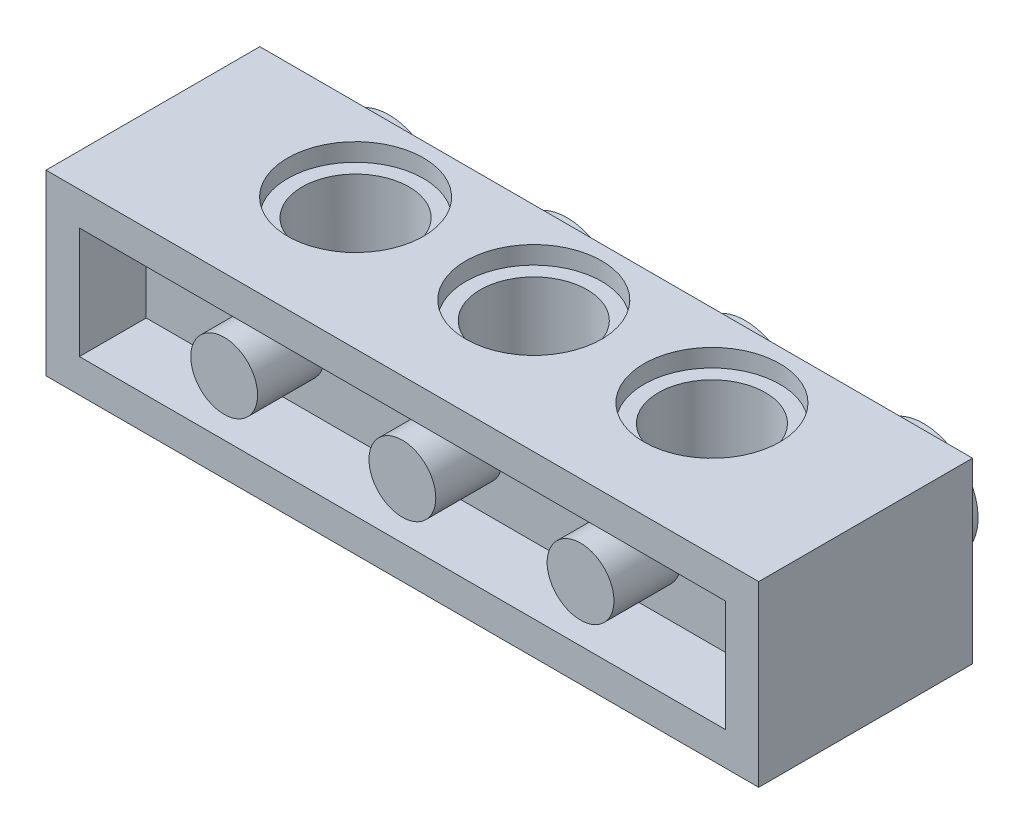
ISO-10303-21;
HEADER;
FILE_DESCRIPTION(('STEP AP214'),'2;1');
FILE_NAME('part.step','',(''),(''),'','','');
FILE_SCHEMA(('AUTOMOTIVE_DESIGN { 1 0 10303 214 1 1 1 1 }'));
ENDSEC;
DATA;
#1=APPLICATION_CONTEXT('core data for automotive mechanical design processes');
#2=APPLICATION_PROTOCOL_DEFINITION('international standard','automotive_design',2000,#1);
#3=PRODUCT_CONTEXT('',#1,'mechanical');
#4=PRODUCT('Part','Part','',(#3));
#5=PRODUCT_RELATED_PRODUCT_CATEGORY('part','',(#4));
#6=PRODUCT_DEFINITION_FORMATION('','',#4);
#7=PRODUCT_DEFINITION_CONTEXT('part definition',#1,'design');
#8=PRODUCT_DEFINITION('design','',#6,#7);
#9=PRODUCT_DEFINITION_SHAPE('','',#8);
#10=(LENGTH_UNIT() NAMED_UNIT(*) SI_UNIT(.MILLI.,.METRE.));
#11=(NAMED_UNIT(*) PLANE_ANGLE_UNIT() SI_UNIT($,.RADIAN.));
#12=(NAMED_UNIT(*) SI_UNIT($,.STERADIAN.) SOLID_ANGLE_UNIT());
#13=UNCERTAINTY_MEASURE_WITH_UNIT(LENGTH_MEASURE(1.E-05),#10,'distance_accuracy_value','');
#14=(GEOMETRIC_REPRESENTATION_CONTEXT(3) GLOBAL_UNCERTAINTY_ASSIGNED_CONTEXT((#13)) GLOBAL_UNIT_ASSIGNED_CONTEXT((#10,
#11,#12)) REPRESENTATION_CONTEXT('',''));
#15=CARTESIAN_POINT('',(0.,0.,0.));
#16=DIRECTION('',(0.,0.,1.));
#17=DIRECTION('',(1.,0.,0.));
#18=AXIS2_PLACEMENT_3D('',#15,#16,#17);
#19=CARTESIAN_POINT('',(0.,0.200000000000001,0.));
#20=DIRECTION('',(0.,1.,0.));
#21=DIRECTION('',(0.,0.,1.));
#22=AXIS2_PLACEMENT_3D('',#19,#20,#21);
#23=CYLINDRICAL_SURFACE('',#22,2.4);
#24=CARTESIAN_POINT('',(0.,7.2,0.));
#25=DIRECTION('',(0.,1.,0.));
#26=DIRECTION('',(0.,0.,1.));
#27=AXIS2_PLACEMENT_3D('',#24,#25,#26);
#28=CIRCLE('',#27,2.4);
#29=CARTESIAN_POINT('',(0.,7.2,2.4));
#30=VERTEX_POINT('',#29);
#31=EDGE_CURVE('E289',#30,#30,#28,.F.);
#32=ORIENTED_EDGE('',*,*,#31,.F.);
#33=EDGE_LOOP('',(#32));
#34=FACE_BOUND('',#33,.T.);
#35=CARTESIAN_POINT('',(0.,0.8,0.));
#36=DIRECTION('',(0.,-1.,0.));
#37=DIRECTION('',(0.,0.,-1.));
#38=AXIS2_PLACEMENT_3D('',#35,#36,#37);
#39=CIRCLE('',#38,2.4);
#40=CARTESIAN_POINT('',(0.,0.8,-2.4));
#41=VERTEX_POINT('',#40);
#42=EDGE_CURVE('E298',#41,#41,#39,.F.);
#43=ORIENTED_EDGE('',*,*,#42,.F.);
#44=EDGE_LOOP('',(#43));
#45=FACE_BOUND('',#44,.T.);
#46=ADVANCED_FACE('F39',(#34,#45),#23,.F.);
#47=CARTESIAN_POINT('',(8.,0.200000000000001,0.));
#48=DIRECTION('',(0.,1.,0.));
#49=DIRECTION('',(0.,0.,1.));
#50=AXIS2_PLACEMENT_3D('',#47,#48,#49);
#51=CYLINDRICAL_SURFACE('',#50,2.4);
#52=CARTESIAN_POINT('',(8.,7.2,0.));
#53=DIRECTION('',(0.,1.,0.));
#54=DIRECTION('',(0.,0.,1.));
#55=AXIS2_PLACEMENT_3D('',#52,#53,#54);
#56=CIRCLE('',#55,2.4);
#57=CARTESIAN_POINT('',(8.,7.2,2.4));
#58=VERTEX_POINT('',#57);
#59=EDGE_CURVE('E268',#58,#58,#56,.F.);
#60=ORIENTED_EDGE('',*,*,#59,.F.);
#61=EDGE_LOOP('',(#60));
#62=FACE_BOUND('',#61,.T.);
#63=CARTESIAN_POINT('',(8.,0.8,0.));
#64=DIRECTION('',(0.,-1.,0.));
#65=DIRECTION('',(0.,0.,-1.));
#66=AXIS2_PLACEMENT_3D('',#63,#64,#65);
#67=CIRCLE('',#66,2.4);
#68=CARTESIAN_POINT('',(8.,0.8,-2.4));
#69=VERTEX_POINT('',#68);
#70=EDGE_CURVE('E206',#69,#69,#67,.F.);
#71=ORIENTED_EDGE('',*,*,#70,.F.);
#72=EDGE_LOOP('',(#71));
#73=FACE_BOUND('',#72,.T.);
#74=ADVANCED_FACE('F335',(#62,#73),#51,.F.);
#75=CARTESIAN_POINT('',(0.,8.,0.));
#76=DIRECTION('',(0.,1.,0.));
#77=DIRECTION('',(0.,0.,1.));
#78=AXIS2_PLACEMENT_3D('',#75,#76,#77);
#79=PLANE('',#78);
#80=CARTESIAN_POINT('',(8.,8.,0.));
#81=DIRECTION('',(0.,1.,0.));
#82=DIRECTION('',(0.,0.,1.));
#83=AXIS2_PLACEMENT_3D('',#80,#81,#82);
#84=CIRCLE('',#83,3.05);
#85=CARTESIAN_POINT('',(8.,8.,3.05));
#86=VERTEX_POINT('',#85);
#87=EDGE_CURVE('E231',#86,#86,#84,.T.);
#88=ORIENTED_EDGE('',*,*,#87,.F.);
#89=EDGE_LOOP('',(#88));
#90=FACE_BOUND('',#89,.T.);
#91=CARTESIAN_POINT('',(0.,8.,0.));
#92=DIRECTION('',(0.,1.,0.));
#93=DIRECTION('',(0.,0.,1.));
#94=AXIS2_PLACEMENT_3D('',#91,#92,#93);
#95=CIRCLE('',#94,3.05);
#96=CARTESIAN_POINT('',(0.,8.,3.05));
#97=VERTEX_POINT('',#96);
#98=EDGE_CURVE('E239',#97,#97,#95,.T.);
#99=ORIENTED_EDGE('',*,*,#98,.F.);
#100=EDGE_LOOP('',(#99));
#101=FACE_BOUND('',#100,.T.);
#102=CARTESIAN_POINT('',(-8.,8.,0.));
#103=DIRECTION('',(0.,1.,0.));
#104=DIRECTION('',(0.,0.,-1.));
#105=AXIS2_PLACEMENT_3D('',#102,#103,#104);
#106=CIRCLE('',#105,3.05);
#107=CARTESIAN_POINT('',(-8.,8.,-3.05));
#108=VERTEX_POINT('',#107);
#109=EDGE_CURVE('E247',#108,#108,#106,.T.);
#110=ORIENTED_EDGE('',*,*,#109,.F.);
#111=EDGE_LOOP('',(#110));
#112=FACE_BOUND('',#111,.T.);
#113=DIRECTION('',(1.,0.,0.));
#114=VECTOR('',#113,1.);
#115=CARTESIAN_POINT('',(-16.,8.,5.9));
#116=LINE('',#115,#114);
#117=CARTESIAN_POINT('',(-16.,8.,5.9));
#118=VERTEX_POINT('',#117);
#119=CARTESIAN_POINT('',(16.,8.,5.9));
#120=VERTEX_POINT('',#119);
#121=EDGE_CURVE('E251',#118,#120,#116,.T.);
#122=ORIENTED_EDGE('',*,*,#121,.T.);
#123=DIRECTION('',(0.,0.,-1.));
#124=VECTOR('',#123,1.);
#125=CARTESIAN_POINT('',(16.,8.,5.9));
#126=LINE('',#125,#124);
#127=CARTESIAN_POINT('',(16.,8.,-3.7));
#128=VERTEX_POINT('',#127);
#129=EDGE_CURVE('E92',#120,#128,#126,.T.);
#130=ORIENTED_EDGE('',*,*,#129,.T.);
#131=DIRECTION('',(1.,0.,0.));
#132=VECTOR('',#131,1.);
#133=CARTESIAN_POINT('',(-16.,8.,-3.7));
#134=LINE('',#133,#132);
#135=CARTESIAN_POINT('',(-16.,8.,-3.7));
#136=VERTEX_POINT('',#135);
#137=EDGE_CURVE('E257',#136,#128,#134,.T.);
#138=ORIENTED_EDGE('',*,*,#137,.F.);
#139=DIRECTION('',(0.,0.,-1.));
#140=VECTOR('',#139,1.);
#141=CARTESIAN_POINT('',(-16.,8.,5.9));
#142=LINE('',#141,#140);
#143=EDGE_CURVE('E261',#118,#136,#142,.T.);
#144=ORIENTED_EDGE('',*,*,#143,.F.);
#145=EDGE_LOOP('',(#122,#130,#138,#144));
#146=FACE_BOUND('',#145,.T.);
#147=ADVANCED_FACE('F332',(#90,#101,#112,#146),#79,.T.);
#148=CARTESIAN_POINT('',(-16.,8.,5.9));
#149=DIRECTION('',(0.,0.,-1.));
#150=DIRECTION('',(-1.,0.,0.));
#151=AXIS2_PLACEMENT_3D('',#148,#149,#150);
#152=PLANE('',#151);
#153=DIRECTION('',(1.,0.,0.));
#154=VECTOR('',#153,1.);
#155=CARTESIAN_POINT('',(-14.5,1.5,5.9));
#156=LINE('',#155,#154);
#157=CARTESIAN_POINT('',(-14.5,1.5,5.9));
#158=VERTEX_POINT('',#157);
#159=CARTESIAN_POINT('',(14.5,1.5,5.9));
#160=VERTEX_POINT('',#159);
#161=EDGE_CURVE('E154',#158,#160,#156,.T.);
#162=ORIENTED_EDGE('',*,*,#161,.F.);
#163=DIRECTION('',(0.,-1.,0.));
#164=VECTOR('',#163,1.);
#165=CARTESIAN_POINT('',(-14.5,6.5,5.9));
#166=LINE('',#165,#164);
#167=CARTESIAN_POINT('',(-14.5,6.5,5.9));
#168=VERTEX_POINT('',#167);
#169=EDGE_CURVE('E57',#168,#158,#166,.T.);
#170=ORIENTED_EDGE('',*,*,#169,.F.);
#171=DIRECTION('',(-1.,0.,0.));
#172=VECTOR('',#171,1.);
#173=CARTESIAN_POINT('',(-14.5,6.5,5.9));
#174=LINE('',#173,#172);
#175=CARTESIAN_POINT('',(14.5,6.5,5.9));
#176=VERTEX_POINT('',#175);
#177=EDGE_CURVE('E138',#176,#168,#174,.T.);
#178=ORIENTED_EDGE('',*,*,#177,.F.);
#179=DIRECTION('',(0.,1.,0.));
#180=VECTOR('',#179,1.);
#181=CARTESIAN_POINT('',(14.5,6.5,5.9));
#182=LINE('',#181,#180);
#183=EDGE_CURVE('E142',#160,#176,#182,.T.);
#184=ORIENTED_EDGE('',*,*,#183,.F.);
#185=EDGE_LOOP('',(#162,#170,#178,#184));
#186=FACE_BOUND('',#185,.T.);
#187=DIRECTION('',(1.,0.,0.));
#188=VECTOR('',#187,1.);
#189=CARTESIAN_POINT('',(-16.,0.,5.9));
#190=LINE('',#189,#188);
#191=CARTESIAN_POINT('',(-16.,0.,5.9));
#192=VERTEX_POINT('',#191);
#193=CARTESIAN_POINT('',(16.,0.,5.9));
#194=VERTEX_POINT('',#193);
#195=EDGE_CURVE('E264',#192,#194,#190,.T.);
#196=ORIENTED_EDGE('',*,*,#195,.T.);
#197=DIRECTION('',(0.,-1.,0.));
#198=VECTOR('',#197,1.);
#199=CARTESIAN_POINT('',(16.,8.,5.9));
#200=LINE('',#199,#198);
#201=EDGE_CURVE('E11',#120,#194,#200,.T.);
#202=ORIENTED_EDGE('',*,*,#201,.F.);
#203=ORIENTED_EDGE('',*,*,#121,.F.);
#204=DIRECTION('',(0.,-1.,0.));
#205=VECTOR('',#204,1.);
#206=CARTESIAN_POINT('',(-16.,8.,5.9));
#207=LINE('',#206,#205);
#208=EDGE_CURVE('E66',#118,#192,#207,.T.);
#209=ORIENTED_EDGE('',*,*,#208,.T.);
#210=EDGE_LOOP('',(#196,#202,#203,#209));
#211=FACE_BOUND('',#210,.T.);
#212=ADVANCED_FACE('F41',(#186,#211),#152,.F.);
#213=CARTESIAN_POINT('',(16.,8.,5.9));
#214=DIRECTION('',(-1.,0.,0.));
#215=DIRECTION('',(0.,0.,1.));
#216=AXIS2_PLACEMENT_3D('',#213,#214,#215);
#217=PLANE('',#216);
#218=DIRECTION('',(0.,0.,-1.));
#219=VECTOR('',#218,1.);
#220=CARTESIAN_POINT('',(16.,0.,5.9));
#221=LINE('',#220,#219);
#222=CARTESIAN_POINT('',(16.,0.,-3.7));
#223=VERTEX_POINT('',#222);
#224=EDGE_CURVE('E267',#194,#223,#221,.T.);
#225=ORIENTED_EDGE('',*,*,#224,.T.);
#226=DIRECTION('',(0.,-1.,0.));
#227=VECTOR('',#226,1.);
#228=CARTESIAN_POINT('',(16.,8.,-3.7));
#229=LINE('',#228,#227);
#230=EDGE_CURVE('E49',#128,#223,#229,.T.);
#231=ORIENTED_EDGE('',*,*,#230,.F.);
#232=ORIENTED_EDGE('',*,*,#129,.F.);
#233=ORIENTED_EDGE('',*,*,#201,.T.);
#234=EDGE_LOOP('',(#225,#231,#232,#233));
#235=FACE_BOUND('',#234,.T.);
#236=ADVANCED_FACE('F341',(#235),#217,.F.);
#237=CARTESIAN_POINT('',(-16.,8.,-3.7));
#238=DIRECTION('',(0.,0.,-1.));
#239=DIRECTION('',(-1.,0.,0.));
#240=AXIS2_PLACEMENT_3D('',#237,#238,#239);
#241=PLANE('',#240);
#242=CARTESIAN_POINT('',(-12.,4.,-3.7));
#243=DIRECTION('',(0.,0.,-1.));
#244=DIRECTION('',(1.,0.,0.));
#245=AXIS2_PLACEMENT_3D('',#242,#243,#244);
#246=CIRCLE('',#245,2.45);
#247=CARTESIAN_POINT('',(-9.55,4.,-3.7));
#248=VERTEX_POINT('',#247);
#249=EDGE_CURVE('E164',#248,#248,#246,.T.);
#250=ORIENTED_EDGE('',*,*,#249,.F.);
#251=EDGE_LOOP('',(#250));
#252=FACE_BOUND('',#251,.T.);
#253=CARTESIAN_POINT('',(4.,4.,-3.7));
#254=DIRECTION('',(0.,0.,-1.));
#255=DIRECTION('',(1.,0.,0.));
#256=AXIS2_PLACEMENT_3D('',#253,#254,#255);
#257=CIRCLE('',#256,2.45);
#258=CARTESIAN_POINT('',(6.45,4.,-3.7));
#259=VERTEX_POINT('',#258);
#260=EDGE_CURVE('E174',#259,#259,#257,.T.);
#261=ORIENTED_EDGE('',*,*,#260,.F.);
#262=EDGE_LOOP('',(#261));
#263=FACE_BOUND('',#262,.T.);
#264=CARTESIAN_POINT('',(-4.,4.,-3.7));
#265=DIRECTION('',(0.,0.,-1.));
#266=DIRECTION('',(-1.,0.,0.));
#267=AXIS2_PLACEMENT_3D('',#264,#265,#266);
#268=CIRCLE('',#267,2.45);
#269=CARTESIAN_POINT('',(-6.45,4.,-3.7));
#270=VERTEX_POINT('',#269);
#271=EDGE_CURVE('E182',#270,#270,#268,.T.);
#272=ORIENTED_EDGE('',*,*,#271,.F.);
#273=EDGE_LOOP('',(#272));
#274=FACE_BOUND('',#273,.T.);
#275=CARTESIAN_POINT('',(12.,4.,-3.7));
#276=DIRECTION('',(0.,0.,-1.));
#277=DIRECTION('',(-1.,0.,0.));
#278=AXIS2_PLACEMENT_3D('',#275,#276,#277);
#279=CIRCLE('',#278,2.45);
#280=CARTESIAN_POINT('',(9.55,4.,-3.7));
#281=VERTEX_POINT('',#280);
#282=EDGE_CURVE('E190',#281,#281,#279,.T.);
#283=ORIENTED_EDGE('',*,*,#282,.F.);
#284=EDGE_LOOP('',(#283));
#285=FACE_BOUND('',#284,.T.);
#286=DIRECTION('',(1.,0.,0.));
#287=VECTOR('',#286,1.);
#288=CARTESIAN_POINT('',(-16.,0.,-3.7));
#289=LINE('',#288,#287);
#290=CARTESIAN_POINT('',(-16.,0.,-3.7));
#291=VERTEX_POINT('',#290);
#292=EDGE_CURVE('E272',#291,#223,#289,.T.);
#293=ORIENTED_EDGE('',*,*,#292,.F.);
#294=DIRECTION('',(0.,-1.,0.));
#295=VECTOR('',#294,1.);
#296=CARTESIAN_POINT('',(-16.,8.,-3.7));
#297=LINE('',#296,#295);
#298=EDGE_CURVE('E281',#136,#291,#297,.T.);
#299=ORIENTED_EDGE('',*,*,#298,.F.);
#300=ORIENTED_EDGE('',*,*,#137,.T.);
#301=ORIENTED_EDGE('',*,*,#230,.T.);
#302=EDGE_LOOP('',(#293,#299,#300,#301));
#303=FACE_BOUND('',#302,.T.);
#304=ADVANCED_FACE('F345',(#252,#263,#274,#285,#303),#241,.T.);
#305=CARTESIAN_POINT('',(-16.,8.,5.9));
#306=DIRECTION('',(-1.,0.,0.));
#307=DIRECTION('',(0.,0.,1.));
#308=AXIS2_PLACEMENT_3D('',#305,#306,#307);
#309=PLANE('',#308);
#310=DIRECTION('',(0.,0.,-1.));
#311=VECTOR('',#310,1.);
#312=CARTESIAN_POINT('',(-16.,0.,5.9));
#313=LINE('',#312,#311);
#314=EDGE_CURVE('E254',#192,#291,#313,.T.);
#315=ORIENTED_EDGE('',*,*,#314,.F.);
#316=ORIENTED_EDGE('',*,*,#208,.F.);
#317=ORIENTED_EDGE('',*,*,#143,.T.);
#318=ORIENTED_EDGE('',*,*,#298,.T.);
#319=EDGE_LOOP('',(#315,#316,#317,#318));
#320=FACE_BOUND('',#319,.T.);
#321=ADVANCED_FACE('F346',(#320),#309,.T.);
#322=CARTESIAN_POINT('',(0.,0.,0.));
#323=DIRECTION('',(0.,1.,0.));
#324=DIRECTION('',(0.,0.,1.));
#325=AXIS2_PLACEMENT_3D('',#322,#323,#324);
#326=PLANE('',#325);
#327=CARTESIAN_POINT('',(8.,0.,0.));
#328=DIRECTION('',(0.,-1.,0.));
#329=DIRECTION('',(0.,0.,-1.));
#330=AXIS2_PLACEMENT_3D('',#327,#328,#329);
#331=CIRCLE('',#330,3.05);
#332=CARTESIAN_POINT('',(8.,0.,-3.05));
#333=VERTEX_POINT('',#332);
#334=EDGE_CURVE('E207',#333,#333,#331,.T.);
#335=ORIENTED_EDGE('',*,*,#334,.F.);
#336=EDGE_LOOP('',(#335));
#337=FACE_BOUND('',#336,.T.);
#338=CARTESIAN_POINT('',(0.,0.,0.));
#339=DIRECTION('',(0.,-1.,0.));
#340=DIRECTION('',(0.,0.,-1.));
#341=AXIS2_PLACEMENT_3D('',#338,#339,#340);
#342=CIRCLE('',#341,3.05);
#343=CARTESIAN_POINT('',(0.,0.,-3.05));
#344=VERTEX_POINT('',#343);
#345=EDGE_CURVE('E215',#344,#344,#342,.T.);
#346=ORIENTED_EDGE('',*,*,#345,.F.);
#347=EDGE_LOOP('',(#346));
#348=FACE_BOUND('',#347,.T.);
#349=CARTESIAN_POINT('',(-8.,0.,0.));
#350=DIRECTION('',(0.,-1.,0.));
#351=DIRECTION('',(0.,0.,1.));
#352=AXIS2_PLACEMENT_3D('',#349,#350,#351);
#353=CIRCLE('',#352,3.05);
#354=CARTESIAN_POINT('',(-8.,0.,3.05));
#355=VERTEX_POINT('',#354);
#356=EDGE_CURVE('E198',#355,#355,#353,.T.);
#357=ORIENTED_EDGE('',*,*,#356,.F.);
#358=EDGE_LOOP('',(#357));
#359=FACE_BOUND('',#358,.T.);
#360=ORIENTED_EDGE('',*,*,#195,.F.);
#361=ORIENTED_EDGE('',*,*,#314,.T.);
#362=ORIENTED_EDGE('',*,*,#292,.T.);
#363=ORIENTED_EDGE('',*,*,#224,.F.);
#364=EDGE_LOOP('',(#360,#361,#362,#363));
#365=FACE_BOUND('',#364,.T.);
#366=ADVANCED_FACE('F328',(#337,#348,#359,#365),#326,.F.);
#367=CARTESIAN_POINT('',(-8.,7.2,0.));
#368=DIRECTION('',(0.,1.,0.));
#369=DIRECTION('',(0.,0.,1.));
#370=AXIS2_PLACEMENT_3D('',#367,#368,#369);
#371=CYLINDRICAL_SURFACE('',#370,3.05);
#372=CARTESIAN_POINT('',(-8.,7.2,0.));
#373=DIRECTION('',(0.,1.,0.));
#374=DIRECTION('',(0.,0.,-1.));
#375=AXIS2_PLACEMENT_3D('',#372,#373,#374);
#376=CIRCLE('',#375,3.05);
#377=CARTESIAN_POINT('',(-8.,7.2,-3.05));
#378=VERTEX_POINT('',#377);
#379=EDGE_CURVE('E243',#378,#378,#376,.T.);
#380=ORIENTED_EDGE('',*,*,#379,.F.);
#381=EDGE_LOOP('',(#380));
#382=FACE_BOUND('',#381,.T.);
#383=ORIENTED_EDGE('',*,*,#109,.T.);
#384=EDGE_LOOP('',(#383));
#385=FACE_BOUND('',#384,.T.);
#386=ADVANCED_FACE('F322',(#382,#385),#371,.F.);
#387=CARTESIAN_POINT('',(-8.,7.2,0.));
#388=DIRECTION('',(0.,-1.,0.));
#389=DIRECTION('',(0.,0.,-1.));
#390=AXIS2_PLACEMENT_3D('',#387,#388,#389);
#391=PLANE('',#390);
#392=CARTESIAN_POINT('',(-8.,7.2,0.));
#393=DIRECTION('',(0.,-1.,0.));
#394=DIRECTION('',(0.,0.,-1.));
#395=AXIS2_PLACEMENT_3D('',#392,#393,#394);
#396=CIRCLE('',#395,2.4);
#397=CARTESIAN_POINT('',(-8.,7.2,-2.4));
#398=VERTEX_POINT('',#397);
#399=EDGE_CURVE('E230',#398,#398,#396,.T.);
#400=ORIENTED_EDGE('',*,*,#399,.T.);
#401=EDGE_LOOP('',(#400));
#402=FACE_BOUND('',#401,.T.);
#403=ORIENTED_EDGE('',*,*,#379,.T.);
#404=EDGE_LOOP('',(#403));
#405=FACE_BOUND('',#404,.T.);
#406=ADVANCED_FACE('F318',(#402,#405),#391,.F.);
#407=CARTESIAN_POINT('',(0.,7.2,0.));
#408=DIRECTION('',(0.,1.,0.));
#409=DIRECTION('',(0.,0.,1.));
#410=AXIS2_PLACEMENT_3D('',#407,#408,#409);
#411=PLANE('',#410);
#412=CARTESIAN_POINT('',(0.,7.2,0.));
#413=DIRECTION('',(0.,1.,0.));
#414=DIRECTION('',(0.,0.,1.));
#415=AXIS2_PLACEMENT_3D('',#412,#413,#414);
#416=CIRCLE('',#415,3.05);
#417=CARTESIAN_POINT('',(0.,7.2,3.05));
#418=VERTEX_POINT('',#417);
#419=EDGE_CURVE('E235',#418,#418,#416,.T.);
#420=ORIENTED_EDGE('',*,*,#419,.T.);
#421=EDGE_LOOP('',(#420));
#422=FACE_BOUND('',#421,.T.);
#423=ORIENTED_EDGE('',*,*,#31,.T.);
#424=EDGE_LOOP('',(#423));
#425=FACE_BOUND('',#424,.T.);
#426=ADVANCED_FACE('F321',(#422,#425),#411,.T.);
#427=CARTESIAN_POINT('',(0.,7.2,0.));
#428=DIRECTION('',(0.,1.,0.));
#429=DIRECTION('',(0.,0.,1.));
#430=AXIS2_PLACEMENT_3D('',#427,#428,#429);
#431=CYLINDRICAL_SURFACE('',#430,3.05);
#432=ORIENTED_EDGE('',*,*,#419,.F.);
#433=EDGE_LOOP('',(#432));
#434=FACE_BOUND('',#433,.T.);
#435=ORIENTED_EDGE('',*,*,#98,.T.);
#436=EDGE_LOOP('',(#435));
#437=FACE_BOUND('',#436,.T.);
#438=ADVANCED_FACE('F368',(#434,#437),#431,.F.);
#439=CARTESIAN_POINT('',(8.,7.2,0.));
#440=DIRECTION('',(0.,1.,0.));
#441=DIRECTION('',(0.,0.,1.));
#442=AXIS2_PLACEMENT_3D('',#439,#440,#441);
#443=PLANE('',#442);
#444=CARTESIAN_POINT('',(8.,7.2,0.));
#445=DIRECTION('',(0.,1.,0.));
#446=DIRECTION('',(0.,0.,1.));
#447=AXIS2_PLACEMENT_3D('',#444,#445,#446);
#448=CIRCLE('',#447,3.05);
#449=CARTESIAN_POINT('',(8.,7.2,3.05));
#450=VERTEX_POINT('',#449);
#451=EDGE_CURVE('E226',#450,#450,#448,.T.);
#452=ORIENTED_EDGE('',*,*,#451,.T.);
#453=EDGE_LOOP('',(#452));
#454=FACE_BOUND('',#453,.T.);
#455=ORIENTED_EDGE('',*,*,#59,.T.);
#456=EDGE_LOOP('',(#455));
#457=FACE_BOUND('',#456,.T.);
#458=ADVANCED_FACE('F371',(#454,#457),#443,.T.);
#459=CARTESIAN_POINT('',(8.,7.2,0.));
#460=DIRECTION('',(0.,1.,0.));
#461=DIRECTION('',(0.,0.,1.));
#462=AXIS2_PLACEMENT_3D('',#459,#460,#461);
#463=CYLINDRICAL_SURFACE('',#462,3.05);
#464=ORIENTED_EDGE('',*,*,#451,.F.);
#465=EDGE_LOOP('',(#464));
#466=FACE_BOUND('',#465,.T.);
#467=ORIENTED_EDGE('',*,*,#87,.T.);
#468=EDGE_LOOP('',(#467));
#469=FACE_BOUND('',#468,.T.);
#470=ADVANCED_FACE('F314',(#466,#469),#463,.F.);
#471=CARTESIAN_POINT('',(-8.,0.200000000000001,0.));
#472=DIRECTION('',(0.,1.,0.));
#473=DIRECTION('',(0.,0.,1.));
#474=AXIS2_PLACEMENT_3D('',#471,#472,#473);
#475=CYLINDRICAL_SURFACE('',#474,2.4);
#476=CARTESIAN_POINT('',(-8.,0.8,0.));
#477=DIRECTION('',(0.,1.,0.));
#478=DIRECTION('',(0.,0.,1.));
#479=AXIS2_PLACEMENT_3D('',#476,#477,#478);
#480=CIRCLE('',#479,2.4);
#481=CARTESIAN_POINT('',(-8.,0.8,2.4));
#482=VERTEX_POINT('',#481);
#483=EDGE_CURVE('E43',#482,#482,#480,.T.);
#484=ORIENTED_EDGE('',*,*,#483,.F.);
#485=EDGE_LOOP('',(#484));
#486=FACE_BOUND('',#485,.T.);
#487=ORIENTED_EDGE('',*,*,#399,.F.);
#488=EDGE_LOOP('',(#487));
#489=FACE_BOUND('',#488,.T.);
#490=ADVANCED_FACE('F310',(#486,#489),#475,.F.);
#491=CARTESIAN_POINT('',(8.,0.8,0.));
#492=DIRECTION('',(0.,-1.,0.));
#493=DIRECTION('',(0.,0.,-1.));
#494=AXIS2_PLACEMENT_3D('',#491,#492,#493);
#495=PLANE('',#494);
#496=CARTESIAN_POINT('',(8.,0.8,0.));
#497=DIRECTION('',(0.,-1.,0.));
#498=DIRECTION('',(0.,0.,-1.));
#499=AXIS2_PLACEMENT_3D('',#496,#497,#498);
#500=CIRCLE('',#499,3.05);
#501=CARTESIAN_POINT('',(8.,0.8,-3.05));
#502=VERTEX_POINT('',#501);
#503=EDGE_CURVE('E202',#502,#502,#500,.T.);
#504=ORIENTED_EDGE('',*,*,#503,.T.);
#505=EDGE_LOOP('',(#504));
#506=FACE_BOUND('',#505,.T.);
#507=ORIENTED_EDGE('',*,*,#70,.T.);
#508=EDGE_LOOP('',(#507));
#509=FACE_BOUND('',#508,.T.);
#510=ADVANCED_FACE('F313',(#506,#509),#495,.T.);
#511=CARTESIAN_POINT('',(8.,0.8,0.));
#512=DIRECTION('',(0.,-1.,0.));
#513=DIRECTION('',(0.,0.,-1.));
#514=AXIS2_PLACEMENT_3D('',#511,#512,#513);
#515=CYLINDRICAL_SURFACE('',#514,3.05);
#516=ORIENTED_EDGE('',*,*,#503,.F.);
#517=EDGE_LOOP('',(#516));
#518=FACE_BOUND('',#517,.T.);
#519=ORIENTED_EDGE('',*,*,#334,.T.);
#520=EDGE_LOOP('',(#519));
#521=FACE_BOUND('',#520,.T.);
#522=ADVANCED_FACE('F396',(#518,#521),#515,.F.);
#523=CARTESIAN_POINT('',(0.,0.8,0.));
#524=DIRECTION('',(0.,-1.,0.));
#525=DIRECTION('',(0.,0.,-1.));
#526=AXIS2_PLACEMENT_3D('',#523,#524,#525);
#527=PLANE('',#526);
#528=CARTESIAN_POINT('',(0.,0.8,0.));
#529=DIRECTION('',(0.,-1.,0.));
#530=DIRECTION('',(0.,0.,-1.));
#531=AXIS2_PLACEMENT_3D('',#528,#529,#530);
#532=CIRCLE('',#531,3.05);
#533=CARTESIAN_POINT('',(0.,0.8,-3.05));
#534=VERTEX_POINT('',#533);
#535=EDGE_CURVE('E211',#534,#534,#532,.T.);
#536=ORIENTED_EDGE('',*,*,#535,.T.);
#537=EDGE_LOOP('',(#536));
#538=FACE_BOUND('',#537,.T.);
#539=ORIENTED_EDGE('',*,*,#42,.T.);
#540=EDGE_LOOP('',(#539));
#541=FACE_BOUND('',#540,.T.);
#542=ADVANCED_FACE('F392',(#538,#541),#527,.T.);
#543=CARTESIAN_POINT('',(0.,0.8,0.));
#544=DIRECTION('',(0.,-1.,0.));
#545=DIRECTION('',(0.,0.,-1.));
#546=AXIS2_PLACEMENT_3D('',#543,#544,#545);
#547=CYLINDRICAL_SURFACE('',#546,3.05);
#548=ORIENTED_EDGE('',*,*,#535,.F.);
#549=EDGE_LOOP('',(#548));
#550=FACE_BOUND('',#549,.T.);
#551=ORIENTED_EDGE('',*,*,#345,.T.);
#552=EDGE_LOOP('',(#551));
#553=FACE_BOUND('',#552,.T.);
#554=ADVANCED_FACE('F385',(#550,#553),#547,.F.);
#555=CARTESIAN_POINT('',(-8.,0.8,0.));
#556=DIRECTION('',(0.,-1.,0.));
#557=DIRECTION('',(0.,0.,-1.));
#558=AXIS2_PLACEMENT_3D('',#555,#556,#557);
#559=CYLINDRICAL_SURFACE('',#558,3.05);
#560=CARTESIAN_POINT('',(-8.,0.8,0.));
#561=DIRECTION('',(0.,-1.,0.));
#562=DIRECTION('',(0.,0.,1.));
#563=AXIS2_PLACEMENT_3D('',#560,#561,#562);
#564=CIRCLE('',#563,3.05);
#565=CARTESIAN_POINT('',(-8.,0.8,3.05));
#566=VERTEX_POINT('',#565);
#567=EDGE_CURVE('E219',#566,#566,#564,.T.);
#568=ORIENTED_EDGE('',*,*,#567,.F.);
#569=EDGE_LOOP('',(#568));
#570=FACE_BOUND('',#569,.T.);
#571=ORIENTED_EDGE('',*,*,#356,.T.);
#572=EDGE_LOOP('',(#571));
#573=FACE_BOUND('',#572,.T.);
#574=ADVANCED_FACE('F382',(#570,#573),#559,.F.);
#575=CARTESIAN_POINT('',(-8.,0.8,0.));
#576=DIRECTION('',(0.,1.,0.));
#577=DIRECTION('',(0.,0.,1.));
#578=AXIS2_PLACEMENT_3D('',#575,#576,#577);
#579=PLANE('',#578);
#580=ORIENTED_EDGE('',*,*,#483,.T.);
#581=EDGE_LOOP('',(#580));
#582=FACE_BOUND('',#581,.T.);
#583=ORIENTED_EDGE('',*,*,#567,.T.);
#584=EDGE_LOOP('',(#583));
#585=FACE_BOUND('',#584,.T.);
#586=ADVANCED_FACE('F307',(#582,#585),#579,.F.);
#587=CARTESIAN_POINT('',(12.,4.,-5.5));
#588=DIRECTION('',(0.,0.,1.));
#589=DIRECTION('',(1.,0.,0.));
#590=AXIS2_PLACEMENT_3D('',#587,#588,#589);
#591=CYLINDRICAL_SURFACE('',#590,2.45);
#592=CARTESIAN_POINT('',(12.,4.,-5.5));
#593=DIRECTION('',(0.,0.,-1.));
#594=DIRECTION('',(-1.,0.,0.));
#595=AXIS2_PLACEMENT_3D('',#592,#593,#594);
#596=CIRCLE('',#595,2.45);
#597=CARTESIAN_POINT('',(9.55,4.,-5.5));
#598=VERTEX_POINT('',#597);
#599=EDGE_CURVE('E194',#598,#598,#596,.T.);
#600=ORIENTED_EDGE('',*,*,#599,.F.);
#601=EDGE_LOOP('',(#600));
#602=FACE_BOUND('',#601,.T.);
#603=ORIENTED_EDGE('',*,*,#282,.T.);
#604=EDGE_LOOP('',(#603));
#605=FACE_BOUND('',#604,.T.);
#606=ADVANCED_FACE('F389',(#602,#605),#591,.T.);
#607=CARTESIAN_POINT('',(12.,4.,-5.5));
#608=DIRECTION('',(0.,0.,-1.));
#609=DIRECTION('',(-1.,0.,0.));
#610=AXIS2_PLACEMENT_3D('',#607,#608,#609);
#611=PLANE('',#610);
#612=ORIENTED_EDGE('',*,*,#599,.T.);
#613=EDGE_LOOP('',(#612));
#614=FACE_BOUND('',#613,.T.);
#615=ADVANCED_FACE('F406',(#614),#611,.T.);
#616=CARTESIAN_POINT('',(-4.,4.,-5.5));
#617=DIRECTION('',(0.,0.,1.));
#618=DIRECTION('',(1.,0.,0.));
#619=AXIS2_PLACEMENT_3D('',#616,#617,#618);
#620=CYLINDRICAL_SURFACE('',#619,2.45);
#621=CARTESIAN_POINT('',(-4.,4.,-5.5));
#622=DIRECTION('',(0.,0.,-1.));
#623=DIRECTION('',(-1.,0.,0.));
#624=AXIS2_PLACEMENT_3D('',#621,#622,#623);
#625=CIRCLE('',#624,2.45);
#626=CARTESIAN_POINT('',(-6.45,4.,-5.5));
#627=VERTEX_POINT('',#626);
#628=EDGE_CURVE('E186',#627,#627,#625,.T.);
#629=ORIENTED_EDGE('',*,*,#628,.F.);
#630=EDGE_LOOP('',(#629));
#631=FACE_BOUND('',#630,.T.);
#632=ORIENTED_EDGE('',*,*,#271,.T.);
#633=EDGE_LOOP('',(#632));
#634=FACE_BOUND('',#633,.T.);
#635=ADVANCED_FACE('F410',(#631,#634),#620,.T.);
#636=CARTESIAN_POINT('',(-4.,4.,-5.5));
#637=DIRECTION('',(0.,0.,-1.));
#638=DIRECTION('',(-1.,0.,0.));
#639=AXIS2_PLACEMENT_3D('',#636,#637,#638);
#640=PLANE('',#639);
#641=ORIENTED_EDGE('',*,*,#628,.T.);
#642=EDGE_LOOP('',(#641));
#643=FACE_BOUND('',#642,.T.);
#644=ADVANCED_FACE('F414',(#643),#640,.T.);
#645=CARTESIAN_POINT('',(4.,4.,-5.5));
#646=DIRECTION('',(0.,0.,1.));
#647=DIRECTION('',(1.,0.,0.));
#648=AXIS2_PLACEMENT_3D('',#645,#646,#647);
#649=CYLINDRICAL_SURFACE('',#648,2.45);
#650=CARTESIAN_POINT('',(4.,4.,-5.5));
#651=DIRECTION('',(0.,0.,-1.));
#652=DIRECTION('',(1.,0.,0.));
#653=AXIS2_PLACEMENT_3D('',#650,#651,#652);
#654=CIRCLE('',#653,2.45);
#655=CARTESIAN_POINT('',(6.45,4.,-5.5));
#656=VERTEX_POINT('',#655);
#657=EDGE_CURVE('E178',#656,#656,#654,.T.);
#658=ORIENTED_EDGE('',*,*,#657,.F.);
#659=EDGE_LOOP('',(#658));
#660=FACE_BOUND('',#659,.T.);
#661=ORIENTED_EDGE('',*,*,#260,.T.);
#662=EDGE_LOOP('',(#661));
#663=FACE_BOUND('',#662,.T.);
#664=ADVANCED_FACE('F418',(#660,#663),#649,.T.);
#665=CARTESIAN_POINT('',(4.,4.,-5.5));
#666=DIRECTION('',(0.,0.,1.));
#667=DIRECTION('',(1.,0.,0.));
#668=AXIS2_PLACEMENT_3D('',#665,#666,#667);
#669=PLANE('',#668);
#670=ORIENTED_EDGE('',*,*,#657,.T.);
#671=EDGE_LOOP('',(#670));
#672=FACE_BOUND('',#671,.T.);
#673=ADVANCED_FACE('F422',(#672),#669,.F.);
#674=CARTESIAN_POINT('',(-12.,4.,-5.5));
#675=DIRECTION('',(0.,0.,1.));
#676=DIRECTION('',(1.,0.,0.));
#677=AXIS2_PLACEMENT_3D('',#674,#675,#676);
#678=CYLINDRICAL_SURFACE('',#677,2.45);
#679=CARTESIAN_POINT('',(-12.,4.,-5.5));
#680=DIRECTION('',(0.,0.,-1.));
#681=DIRECTION('',(1.,0.,0.));
#682=AXIS2_PLACEMENT_3D('',#679,#680,#681);
#683=CIRCLE('',#682,2.45);
#684=CARTESIAN_POINT('',(-9.55,4.,-5.5));
#685=VERTEX_POINT('',#684);
#686=EDGE_CURVE('E170',#685,#685,#683,.T.);
#687=ORIENTED_EDGE('',*,*,#686,.F.);
#688=EDGE_LOOP('',(#687));
#689=FACE_BOUND('',#688,.T.);
#690=ORIENTED_EDGE('',*,*,#249,.T.);
#691=EDGE_LOOP('',(#690));
#692=FACE_BOUND('',#691,.T.);
#693=ADVANCED_FACE('F426',(#689,#692),#678,.T.);
#694=CARTESIAN_POINT('',(-12.,4.,-5.5));
#695=DIRECTION('',(0.,0.,1.));
#696=DIRECTION('',(1.,0.,0.));
#697=AXIS2_PLACEMENT_3D('',#694,#695,#696);
#698=PLANE('',#697);
#699=ORIENTED_EDGE('',*,*,#686,.T.);
#700=EDGE_LOOP('',(#699));
#701=FACE_BOUND('',#700,.T.);
#702=ADVANCED_FACE('F430',(#701),#698,.F.);
#703=CARTESIAN_POINT('',(-14.5,6.5,2.9));
#704=DIRECTION('',(-1.,0.,0.));
#705=DIRECTION('',(0.,0.,1.));
#706=AXIS2_PLACEMENT_3D('',#703,#704,#705);
#707=PLANE('',#706);
#708=ORIENTED_EDGE('',*,*,#169,.T.);
#709=DIRECTION('',(0.,0.,1.));
#710=VECTOR('',#709,1.);
#711=CARTESIAN_POINT('',(-14.5,1.5,2.9));
#712=LINE('',#711,#710);
#713=CARTESIAN_POINT('',(-14.5,1.5,2.9));
#714=VERTEX_POINT('',#713);
#715=EDGE_CURVE('E113',#714,#158,#712,.T.);
#716=ORIENTED_EDGE('',*,*,#715,.F.);
#717=DIRECTION('',(0.,-1.,0.));
#718=VECTOR('',#717,1.);
#719=CARTESIAN_POINT('',(-14.5,6.5,2.9));
#720=LINE('',#719,#718);
#721=CARTESIAN_POINT('',(-14.5,6.5,2.9));
#722=VERTEX_POINT('',#721);
#723=EDGE_CURVE('E117',#722,#714,#720,.T.);
#724=ORIENTED_EDGE('',*,*,#723,.F.);
#725=DIRECTION('',(0.,0.,1.));
#726=VECTOR('',#725,1.);
#727=CARTESIAN_POINT('',(-14.5,6.5,2.9));
#728=LINE('',#727,#726);
#729=EDGE_CURVE('E161',#722,#168,#728,.T.);
#730=ORIENTED_EDGE('',*,*,#729,.T.);
#731=EDGE_LOOP('',(#708,#716,#724,#730));
#732=FACE_BOUND('',#731,.T.);
#733=ADVANCED_FACE('F115',(#732),#707,.F.);
#734=CARTESIAN_POINT('',(-14.5,6.5,2.9));
#735=DIRECTION('',(0.,1.,0.));
#736=DIRECTION('',(0.,0.,1.));
#737=AXIS2_PLACEMENT_3D('',#734,#735,#736);
#738=PLANE('',#737);
#739=ORIENTED_EDGE('',*,*,#177,.T.);
#740=ORIENTED_EDGE('',*,*,#729,.F.);
#741=DIRECTION('',(-1.,0.,0.));
#742=VECTOR('',#741,1.);
#743=CARTESIAN_POINT('',(-14.5,6.5,2.9));
#744=LINE('',#743,#742);
#745=CARTESIAN_POINT('',(14.5,6.5,2.9));
#746=VERTEX_POINT('',#745);
#747=EDGE_CURVE('E124',#746,#722,#744,.T.);
#748=ORIENTED_EDGE('',*,*,#747,.F.);
#749=DIRECTION('',(0.,0.,1.));
#750=VECTOR('',#749,1.);
#751=CARTESIAN_POINT('',(14.5,6.5,2.9));
#752=LINE('',#751,#750);
#753=EDGE_CURVE('E165',#746,#176,#752,.T.);
#754=ORIENTED_EDGE('',*,*,#753,.T.);
#755=EDGE_LOOP('',(#739,#740,#748,#754));
#756=FACE_BOUND('',#755,.T.);
#757=ADVANCED_FACE('F437',(#756),#738,.F.);
#758=CARTESIAN_POINT('',(14.5,6.5,2.9));
#759=DIRECTION('',(1.,0.,0.));
#760=DIRECTION('',(0.,0.,-1.));
#761=AXIS2_PLACEMENT_3D('',#758,#759,#760);
#762=PLANE('',#761);
#763=ORIENTED_EDGE('',*,*,#183,.T.);
#764=ORIENTED_EDGE('',*,*,#753,.F.);
#765=DIRECTION('',(0.,1.,0.));
#766=VECTOR('',#765,1.);
#767=CARTESIAN_POINT('',(14.5,6.5,2.9));
#768=LINE('',#767,#766);
#769=CARTESIAN_POINT('',(14.5,1.5,2.9));
#770=VERTEX_POINT('',#769);
#771=EDGE_CURVE('E133',#770,#746,#768,.T.);
#772=ORIENTED_EDGE('',*,*,#771,.F.);
#773=DIRECTION('',(0.,0.,1.));
#774=VECTOR('',#773,1.);
#775=CARTESIAN_POINT('',(14.5,1.5,2.9));
#776=LINE('',#775,#774);
#777=EDGE_CURVE('E123',#770,#160,#776,.T.);
#778=ORIENTED_EDGE('',*,*,#777,.T.);
#779=EDGE_LOOP('',(#763,#764,#772,#778));
#780=FACE_BOUND('',#779,.T.);
#781=ADVANCED_FACE('F440',(#780),#762,.F.);
#782=CARTESIAN_POINT('',(-14.5,1.5,2.9));
#783=DIRECTION('',(0.,-1.,0.));
#784=DIRECTION('',(0.,0.,-1.));
#785=AXIS2_PLACEMENT_3D('',#782,#783,#784);
#786=PLANE('',#785);
#787=ORIENTED_EDGE('',*,*,#161,.T.);
#788=ORIENTED_EDGE('',*,*,#777,.F.);
#789=DIRECTION('',(1.,0.,0.));
#790=VECTOR('',#789,1.);
#791=CARTESIAN_POINT('',(-14.5,1.5,2.9));
#792=LINE('',#791,#790);
#793=EDGE_CURVE('E127',#714,#770,#792,.T.);
#794=ORIENTED_EDGE('',*,*,#793,.F.);
#795=ORIENTED_EDGE('',*,*,#715,.T.);
#796=EDGE_LOOP('',(#787,#788,#794,#795));
#797=FACE_BOUND('',#796,.T.);
#798=ADVANCED_FACE('F128',(#797),#786,.F.);
#799=CARTESIAN_POINT('',(0.,0.,2.9));
#800=DIRECTION('',(0.,0.,1.));
#801=DIRECTION('',(1.,0.,0.));
#802=AXIS2_PLACEMENT_3D('',#799,#800,#801);
#803=PLANE('',#802);
#804=CARTESIAN_POINT('',(8.,4.,2.9));
#805=DIRECTION('',(0.,0.,1.));
#806=DIRECTION('',(1.,0.,0.));
#807=AXIS2_PLACEMENT_3D('',#804,#805,#806);
#808=CIRCLE('',#807,1.5);
#809=CARTESIAN_POINT('',(9.5,4.,2.9));
#810=VERTEX_POINT('',#809);
#811=EDGE_CURVE('E480',#810,#810,#808,.T.);
#812=ORIENTED_EDGE('',*,*,#811,.F.);
#813=EDGE_LOOP('',(#812));
#814=FACE_BOUND('',#813,.T.);
#815=CARTESIAN_POINT('',(0.,4.,2.9));
#816=DIRECTION('',(0.,0.,1.));
#817=DIRECTION('',(1.,0.,0.));
#818=AXIS2_PLACEMENT_3D('',#815,#816,#817);
#819=CIRCLE('',#818,1.5);
#820=CARTESIAN_POINT('',(1.5,4.,2.9));
#821=VERTEX_POINT('',#820);
#822=EDGE_CURVE('E479',#821,#821,#819,.T.);
#823=ORIENTED_EDGE('',*,*,#822,.F.);
#824=EDGE_LOOP('',(#823));
#825=FACE_BOUND('',#824,.T.);
#826=CARTESIAN_POINT('',(-8.,4.,2.9));
#827=DIRECTION('',(0.,0.,1.));
#828=DIRECTION('',(1.,0.,0.));
#829=AXIS2_PLACEMENT_3D('',#826,#827,#828);
#830=CIRCLE('',#829,1.5);
#831=CARTESIAN_POINT('',(-6.5,4.,2.9));
#832=VERTEX_POINT('',#831);
#833=EDGE_CURVE('E145',#832,#832,#830,.T.);
#834=ORIENTED_EDGE('',*,*,#833,.F.);
#835=EDGE_LOOP('',(#834));
#836=FACE_BOUND('',#835,.T.);
#837=ORIENTED_EDGE('',*,*,#723,.T.);
#838=ORIENTED_EDGE('',*,*,#793,.T.);
#839=ORIENTED_EDGE('',*,*,#771,.T.);
#840=ORIENTED_EDGE('',*,*,#747,.T.);
#841=EDGE_LOOP('',(#837,#838,#839,#840));
#842=FACE_BOUND('',#841,.T.);
#843=ADVANCED_FACE('F135',(#814,#825,#836,#842),#803,.T.);
#844=CARTESIAN_POINT('',(-8.,4.,5.9));
#845=DIRECTION('',(0.,0.,-1.));
#846=DIRECTION('',(-1.,0.,0.));
#847=AXIS2_PLACEMENT_3D('',#844,#845,#846);
#848=CYLINDRICAL_SURFACE('',#847,1.5);
#849=CARTESIAN_POINT('',(-8.,4.,5.9));
#850=DIRECTION('',(0.,0.,1.));
#851=DIRECTION('',(1.,0.,0.));
#852=AXIS2_PLACEMENT_3D('',#849,#850,#851);
#853=CIRCLE('',#852,1.5);
#854=CARTESIAN_POINT('',(-6.5,4.,5.9));
#855=VERTEX_POINT('',#854);
#856=EDGE_CURVE('E155',#855,#855,#853,.T.);
#857=ORIENTED_EDGE('',*,*,#856,.F.);
#858=EDGE_LOOP('',(#857));
#859=FACE_BOUND('',#858,.T.);
#860=ORIENTED_EDGE('',*,*,#833,.T.);
#861=EDGE_LOOP('',(#860));
#862=FACE_BOUND('',#861,.T.);
#863=ADVANCED_FACE('F449',(#859,#862),#848,.T.);
#864=CARTESIAN_POINT('',(-8.,4.,5.9));
#865=DIRECTION('',(0.,0.,1.));
#866=DIRECTION('',(1.,0.,0.));
#867=AXIS2_PLACEMENT_3D('',#864,#865,#866);
#868=PLANE('',#867);
#869=ORIENTED_EDGE('',*,*,#856,.T.);
#870=EDGE_LOOP('',(#869));
#871=FACE_BOUND('',#870,.T.);
#872=ADVANCED_FACE('F453',(#871),#868,.T.);
#873=CARTESIAN_POINT('',(0.,4.,5.9));
#874=DIRECTION('',(0.,0.,-1.));
#875=DIRECTION('',(-1.,0.,0.));
#876=AXIS2_PLACEMENT_3D('',#873,#874,#875);
#877=CYLINDRICAL_SURFACE('',#876,1.5);
#878=CARTESIAN_POINT('',(0.,4.,5.9));
#879=DIRECTION('',(0.,0.,1.));
#880=DIRECTION('',(1.,0.,0.));
#881=AXIS2_PLACEMENT_3D('',#878,#879,#880);
#882=CIRCLE('',#881,1.5);
#883=CARTESIAN_POINT('',(1.5,4.,5.9));
#884=VERTEX_POINT('',#883);
#885=EDGE_CURVE('E485',#884,#884,#882,.T.);
#886=ORIENTED_EDGE('',*,*,#885,.F.);
#887=EDGE_LOOP('',(#886));
#888=FACE_BOUND('',#887,.T.);
#889=ORIENTED_EDGE('',*,*,#822,.T.);
#890=EDGE_LOOP('',(#889));
#891=FACE_BOUND('',#890,.T.);
#892=ADVANCED_FACE('F457',(#888,#891),#877,.T.);
#893=CARTESIAN_POINT('',(0.,4.,5.9));
#894=DIRECTION('',(0.,0.,1.));
#895=DIRECTION('',(1.,0.,0.));
#896=AXIS2_PLACEMENT_3D('',#893,#894,#895);
#897=PLANE('',#896);
#898=ORIENTED_EDGE('',*,*,#885,.T.);
#899=EDGE_LOOP('',(#898));
#900=FACE_BOUND('',#899,.T.);
#901=ADVANCED_FACE('F461',(#900),#897,.T.);
#902=CARTESIAN_POINT('',(8.,4.,5.9));
#903=DIRECTION('',(0.,0.,-1.));
#904=DIRECTION('',(-1.,0.,0.));
#905=AXIS2_PLACEMENT_3D('',#902,#903,#904);
#906=CYLINDRICAL_SURFACE('',#905,1.5);
#907=CARTESIAN_POINT('',(8.,4.,5.9));
#908=DIRECTION('',(0.,0.,1.));
#909=DIRECTION('',(1.,0.,0.));
#910=AXIS2_PLACEMENT_3D('',#907,#908,#909);
#911=CIRCLE('',#910,1.5);
#912=CARTESIAN_POINT('',(9.5,4.,5.9));
#913=VERTEX_POINT('',#912);
#914=EDGE_CURVE('E477',#913,#913,#911,.T.);
#915=ORIENTED_EDGE('',*,*,#914,.F.);
#916=EDGE_LOOP('',(#915));
#917=FACE_BOUND('',#916,.T.);
#918=ORIENTED_EDGE('',*,*,#811,.T.);
#919=EDGE_LOOP('',(#918));
#920=FACE_BOUND('',#919,.T.);
#921=ADVANCED_FACE('F465',(#917,#920),#906,.T.);
#922=CARTESIAN_POINT('',(8.,4.,5.9));
#923=DIRECTION('',(0.,0.,1.));
#924=DIRECTION('',(1.,0.,0.));
#925=AXIS2_PLACEMENT_3D('',#922,#923,#924);
#926=PLANE('',#925);
#927=ORIENTED_EDGE('',*,*,#914,.T.);
#928=EDGE_LOOP('',(#927));
#929=FACE_BOUND('',#928,.T.);
#930=ADVANCED_FACE('F469',(#929),#926,.T.);
#931=CLOSED_SHELL('',(#46,#74,#147,#212,#236,#304,#321,#366,#386,#406,#426,#438,#458,#470,#490,
#510,#522,#542,#554,#574,#586,#606,#615,#635,#644,#664,#673,#693,#702,#733,#757,#781,#798,#843,
#863,#872,#892,#901,#921,#930));
#932=MANIFOLD_SOLID_BREP('B2',#931);
#933=ADVANCED_BREP_SHAPE_REPRESENTATION('',(#18,#932),#14);
#934=SHAPE_DEFINITION_REPRESENTATION(#9,#933);
ENDSEC;
END-ISO-10303-21;
